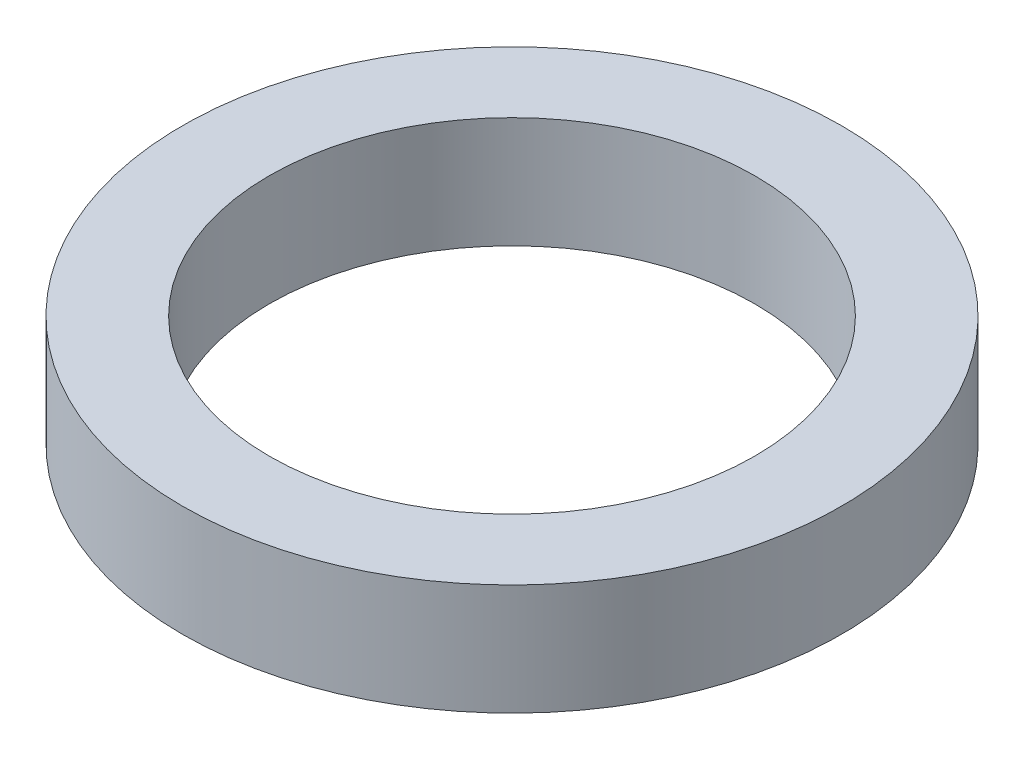
ISO-10303-21;
HEADER;
FILE_DESCRIPTION(('STEP AP214'),'2;1');
FILE_NAME('part.step','',(''),(''),'','','');
FILE_SCHEMA(('AUTOMOTIVE_DESIGN { 1 0 10303 214 1 1 1 1 }'));
ENDSEC;
DATA;
#1=APPLICATION_CONTEXT('core data for automotive mechanical design processes');
#2=APPLICATION_PROTOCOL_DEFINITION('international standard','automotive_design',2000,#1);
#3=PRODUCT_CONTEXT('',#1,'mechanical');
#4=PRODUCT('Part','Part','',(#3));
#5=PRODUCT_RELATED_PRODUCT_CATEGORY('part','',(#4));
#6=PRODUCT_DEFINITION_FORMATION('','',#4);
#7=PRODUCT_DEFINITION_CONTEXT('part definition',#1,'design');
#8=PRODUCT_DEFINITION('design','',#6,#7);
#9=PRODUCT_DEFINITION_SHAPE('','',#8);
#10=(LENGTH_UNIT() NAMED_UNIT(*) SI_UNIT(.MILLI.,.METRE.));
#11=(NAMED_UNIT(*) PLANE_ANGLE_UNIT() SI_UNIT($,.RADIAN.));
#12=(NAMED_UNIT(*) SI_UNIT($,.STERADIAN.) SOLID_ANGLE_UNIT());
#13=UNCERTAINTY_MEASURE_WITH_UNIT(LENGTH_MEASURE(1.E-05),#10,'distance_accuracy_value','');
#14=(GEOMETRIC_REPRESENTATION_CONTEXT(3) GLOBAL_UNCERTAINTY_ASSIGNED_CONTEXT((#13)) GLOBAL_UNIT_ASSIGNED_CONTEXT((#10,
#11,#12)) REPRESENTATION_CONTEXT('',''));
#15=CARTESIAN_POINT('',(0.,0.,0.));
#16=DIRECTION('',(0.,0.,1.));
#17=DIRECTION('',(1.,0.,0.));
#18=AXIS2_PLACEMENT_3D('',#15,#16,#17);
#19=CARTESIAN_POINT('',(0.,16.,0.));
#20=DIRECTION('',(0.,-1.,0.));
#21=DIRECTION('',(0.,0.,-1.));
#22=AXIS2_PLACEMENT_3D('',#19,#20,#21);
#23=CYLINDRICAL_SURFACE('',#22,47.5);
#24=CARTESIAN_POINT('',(0.,16.,0.));
#25=DIRECTION('',(0.,1.,0.));
#26=DIRECTION('',(0.,0.,1.));
#27=AXIS2_PLACEMENT_3D('',#24,#25,#26);
#28=CIRCLE('',#27,47.5);
#29=CARTESIAN_POINT('',(0.,16.,47.5));
#30=VERTEX_POINT('',#29);
#31=EDGE_CURVE('E10',#30,#30,#28,.T.);
#32=ORIENTED_EDGE('',*,*,#31,.F.);
#33=EDGE_LOOP('',(#32));
#34=FACE_BOUND('',#33,.T.);
#35=CARTESIAN_POINT('',(0.,0.,0.));
#36=DIRECTION('',(0.,1.,0.));
#37=DIRECTION('',(0.,0.,1.));
#38=AXIS2_PLACEMENT_3D('',#35,#36,#37);
#39=CIRCLE('',#38,47.5);
#40=CARTESIAN_POINT('',(0.,0.,47.5));
#41=VERTEX_POINT('',#40);
#42=EDGE_CURVE('E37',#41,#41,#39,.T.);
#43=ORIENTED_EDGE('',*,*,#42,.T.);
#44=EDGE_LOOP('',(#43));
#45=FACE_BOUND('',#44,.T.);
#46=ADVANCED_FACE('F40',(#34,#45),#23,.T.);
#47=CARTESIAN_POINT('',(0.,16.,0.));
#48=DIRECTION('',(0.,1.,0.));
#49=DIRECTION('',(0.,0.,1.));
#50=AXIS2_PLACEMENT_3D('',#47,#48,#49);
#51=PLANE('',#50);
#52=CARTESIAN_POINT('',(0.,16.,0.));
#53=DIRECTION('',(0.,1.,0.));
#54=DIRECTION('',(0.,0.,1.));
#55=AXIS2_PLACEMENT_3D('',#52,#53,#54);
#56=CIRCLE('',#55,35.);
#57=CARTESIAN_POINT('',(0.,16.,35.));
#58=VERTEX_POINT('',#57);
#59=EDGE_CURVE('E50',#58,#58,#56,.T.);
#60=ORIENTED_EDGE('',*,*,#59,.F.);
#61=EDGE_LOOP('',(#60));
#62=FACE_BOUND('',#61,.T.);
#63=ORIENTED_EDGE('',*,*,#31,.T.);
#64=EDGE_LOOP('',(#63));
#65=FACE_BOUND('',#64,.T.);
#66=ADVANCED_FACE('F59',(#62,#65),#51,.T.);
#67=CARTESIAN_POINT('',(0.,0.,0.));
#68=DIRECTION('',(0.,1.,0.));
#69=DIRECTION('',(0.,0.,1.));
#70=AXIS2_PLACEMENT_3D('',#67,#68,#69);
#71=PLANE('',#70);
#72=CARTESIAN_POINT('',(0.,0.,0.));
#73=DIRECTION('',(0.,1.,0.));
#74=DIRECTION('',(0.,0.,1.));
#75=AXIS2_PLACEMENT_3D('',#72,#73,#74);
#76=CIRCLE('',#75,35.);
#77=CARTESIAN_POINT('',(0.,0.,35.));
#78=VERTEX_POINT('',#77);
#79=EDGE_CURVE('E47',#78,#78,#76,.T.);
#80=ORIENTED_EDGE('',*,*,#79,.T.);
#81=EDGE_LOOP('',(#80));
#82=FACE_BOUND('',#81,.T.);
#83=ORIENTED_EDGE('',*,*,#42,.F.);
#84=EDGE_LOOP('',(#83));
#85=FACE_BOUND('',#84,.T.);
#86=ADVANCED_FACE('F58',(#82,#85),#71,.F.);
#87=CARTESIAN_POINT('',(0.,16.,0.));
#88=DIRECTION('',(0.,-1.,0.));
#89=DIRECTION('',(0.,0.,-1.));
#90=AXIS2_PLACEMENT_3D('',#87,#88,#89);
#91=CYLINDRICAL_SURFACE('',#90,35.);
#92=ORIENTED_EDGE('',*,*,#59,.T.);
#93=EDGE_LOOP('',(#92));
#94=FACE_BOUND('',#93,.T.);
#95=ORIENTED_EDGE('',*,*,#79,.F.);
#96=EDGE_LOOP('',(#95));
#97=FACE_BOUND('',#96,.T.);
#98=ADVANCED_FACE('F54',(#94,#97),#91,.F.);
#99=CLOSED_SHELL('',(#46,#66,#86,#98));
#100=MANIFOLD_SOLID_BREP('B2',#99);
#101=ADVANCED_BREP_SHAPE_REPRESENTATION('',(#18,#100),#14);
#102=SHAPE_DEFINITION_REPRESENTATION(#9,#101);
ENDSEC;
END-ISO-10303-21;
